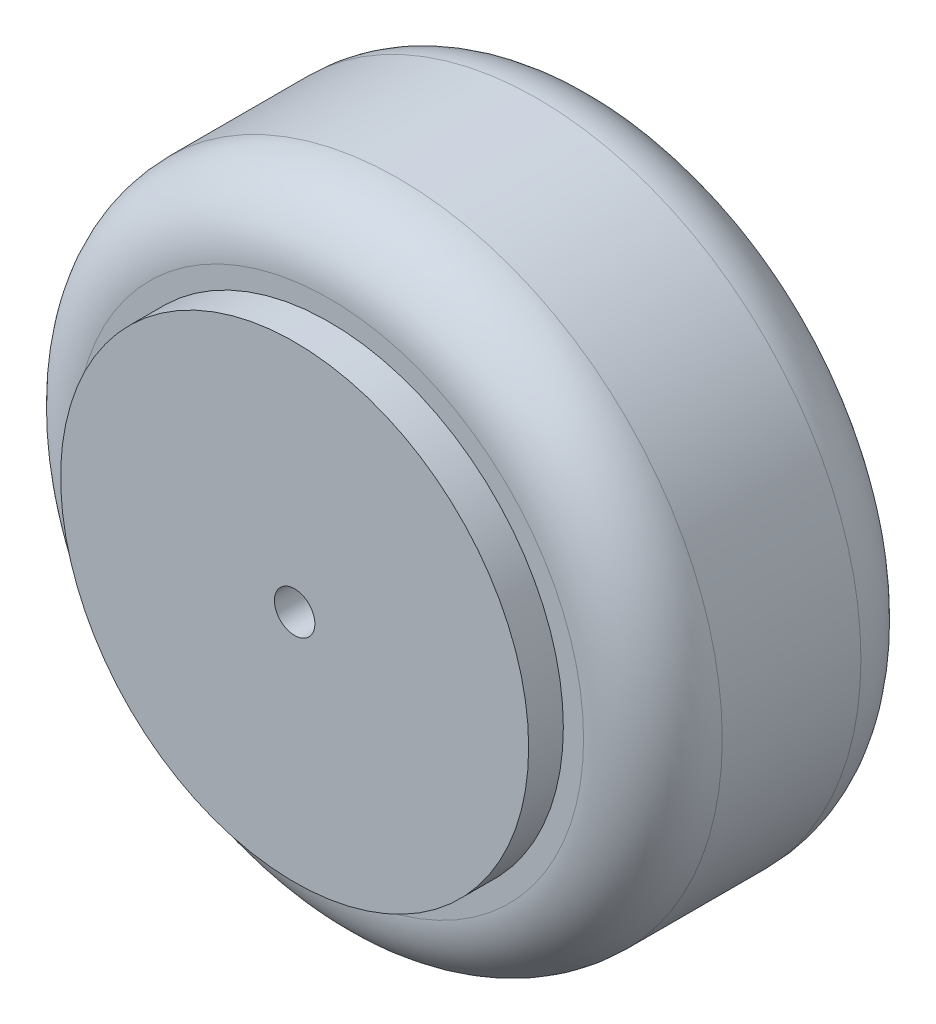
ISO-10303-21;
HEADER;
FILE_DESCRIPTION(('STEP AP214'),'2;1');
FILE_NAME('part.step','',(''),(''),'','','');
FILE_SCHEMA(('AUTOMOTIVE_DESIGN { 1 0 10303 214 1 1 1 1 }'));
ENDSEC;
DATA;
#1=APPLICATION_CONTEXT('core data for automotive mechanical design processes');
#2=APPLICATION_PROTOCOL_DEFINITION('international standard','automotive_design',2000,#1);
#3=PRODUCT_CONTEXT('',#1,'mechanical');
#4=PRODUCT('Part','Part','',(#3));
#5=PRODUCT_RELATED_PRODUCT_CATEGORY('part','',(#4));
#6=PRODUCT_DEFINITION_FORMATION('','',#4);
#7=PRODUCT_DEFINITION_CONTEXT('part definition',#1,'design');
#8=PRODUCT_DEFINITION('design','',#6,#7);
#9=PRODUCT_DEFINITION_SHAPE('','',#8);
#10=(LENGTH_UNIT() NAMED_UNIT(*) SI_UNIT(.MILLI.,.METRE.));
#11=(NAMED_UNIT(*) PLANE_ANGLE_UNIT() SI_UNIT($,.RADIAN.));
#12=(NAMED_UNIT(*) SI_UNIT($,.STERADIAN.) SOLID_ANGLE_UNIT());
#13=UNCERTAINTY_MEASURE_WITH_UNIT(LENGTH_MEASURE(1.E-05),#10,'distance_accuracy_value','');
#14=(GEOMETRIC_REPRESENTATION_CONTEXT(3) GLOBAL_UNCERTAINTY_ASSIGNED_CONTEXT((#13)) GLOBAL_UNIT_ASSIGNED_CONTEXT((#10,
#11,#12)) REPRESENTATION_CONTEXT('',''));
#15=CARTESIAN_POINT('',(0.,0.,0.));
#16=DIRECTION('',(0.,0.,1.));
#17=DIRECTION('',(1.,0.,0.));
#18=AXIS2_PLACEMENT_3D('',#15,#16,#17);
#19=CARTESIAN_POINT('',(0.,0.,6.));
#20=DIRECTION('',(0.,0.,-1.));
#21=DIRECTION('',(-1.,0.,0.));
#22=AXIS2_PLACEMENT_3D('',#19,#20,#21);
#23=CYLINDRICAL_SURFACE('',#22,40.5);
#24=CARTESIAN_POINT('',(0.,0.,6.));
#25=DIRECTION('',(0.,0.,1.));
#26=DIRECTION('',(1.,0.,0.));
#27=AXIS2_PLACEMENT_3D('',#24,#25,#26);
#28=CIRCLE('',#27,40.5);
#29=CARTESIAN_POINT('',(40.5,0.,6.));
#30=VERTEX_POINT('',#29);
#31=EDGE_CURVE('E103',#30,#30,#28,.T.);
#32=ORIENTED_EDGE('',*,*,#31,.F.);
#33=EDGE_LOOP('',(#32));
#34=FACE_BOUND('',#33,.T.);
#35=CARTESIAN_POINT('',(0.,0.,0.));
#36=DIRECTION('',(0.,0.,1.));
#37=DIRECTION('',(1.,0.,0.));
#38=AXIS2_PLACEMENT_3D('',#35,#36,#37);
#39=CIRCLE('',#38,40.5);
#40=CARTESIAN_POINT('',(40.5,0.,0.));
#41=VERTEX_POINT('',#40);
#42=EDGE_CURVE('E102',#41,#41,#39,.T.);
#43=ORIENTED_EDGE('',*,*,#42,.T.);
#44=EDGE_LOOP('',(#43));
#45=FACE_BOUND('',#44,.T.);
#46=ADVANCED_FACE('F44',(#34,#45),#23,.T.);
#47=CARTESIAN_POINT('',(0.,0.,6.));
#48=DIRECTION('',(0.,0.,1.));
#49=DIRECTION('',(1.,0.,0.));
#50=AXIS2_PLACEMENT_3D('',#47,#48,#49);
#51=PLANE('',#50);
#52=CARTESIAN_POINT('',(0.,0.,6.));
#53=DIRECTION('',(0.,0.,-1.));
#54=DIRECTION('',(-1.,0.,0.));
#55=AXIS2_PLACEMENT_3D('',#52,#53,#54);
#56=CIRCLE('',#55,3.5);
#57=CARTESIAN_POINT('',(-3.5,0.,6.));
#58=VERTEX_POINT('',#57);
#59=EDGE_CURVE('E128',#58,#58,#56,.T.);
#60=ORIENTED_EDGE('',*,*,#59,.T.);
#61=EDGE_LOOP('',(#60));
#62=FACE_BOUND('',#61,.T.);
#63=ORIENTED_EDGE('',*,*,#31,.T.);
#64=EDGE_LOOP('',(#63));
#65=FACE_BOUND('',#64,.T.);
#66=ADVANCED_FACE('F134',(#62,#65),#51,.T.);
#67=CARTESIAN_POINT('',(56.,0.,-48.));
#68=DIRECTION('',(0.,0.,-1.));
#69=DIRECTION('',(-1.,0.,0.));
#70=AXIS2_PLACEMENT_3D('',#67,#68,#69);
#71=PLANE('',#70);
#72=CARTESIAN_POINT('',(0.,0.,-48.));
#73=DIRECTION('',(0.,0.,-1.));
#74=DIRECTION('',(-1.,0.,0.));
#75=AXIS2_PLACEMENT_3D('',#72,#73,#74);
#76=CIRCLE('',#75,44.);
#77=CARTESIAN_POINT('',(44.,0.,-48.));
#78=VERTEX_POINT('',#77);
#79=EDGE_CURVE('E117',#78,#78,#76,.T.);
#80=ORIENTED_EDGE('',*,*,#79,.T.);
#81=EDGE_LOOP('',(#80));
#82=FACE_BOUND('',#81,.T.);
#83=CARTESIAN_POINT('',(0.,0.,-48.));
#84=DIRECTION('',(0.,0.,-1.));
#85=DIRECTION('',(-1.,0.,0.));
#86=AXIS2_PLACEMENT_3D('',#83,#84,#85);
#87=CIRCLE('',#86,28.);
#88=CARTESIAN_POINT('',(28.,0.,-48.));
#89=VERTEX_POINT('',#88);
#90=EDGE_CURVE('E53',#89,#89,#87,.F.);
#91=ORIENTED_EDGE('',*,*,#90,.T.);
#92=EDGE_LOOP('',(#91));
#93=FACE_BOUND('',#92,.T.);
#94=ADVANCED_FACE('F152',(#82,#93),#71,.T.);
#95=CARTESIAN_POINT('',(0.,0.,-24.));
#96=DIRECTION('',(0.,0.,1.));
#97=DIRECTION('',(1.,0.,0.));
#98=AXIS2_PLACEMENT_3D('',#95,#96,#97);
#99=CYLINDRICAL_SURFACE('',#98,56.);
#100=DIRECTION('',(0.,0.,-1.));
#101=VECTOR('',#100,1.);
#102=CARTESIAN_POINT('',(56.,0.,-48.));
#103=LINE('',#102,#101);
#104=CARTESIAN_POINT('',(56.,0.,-12.));
#105=VERTEX_POINT('',#104);
#106=CARTESIAN_POINT('',(56.,0.,-36.));
#107=VERTEX_POINT('',#106);
#108=EDGE_CURVE('E91',#105,#107,#103,.T.);
#109=ORIENTED_EDGE('',*,*,#108,.F.);
#110=CARTESIAN_POINT('',(0.,0.,-12.));
#111=DIRECTION('',(0.,0.,1.));
#112=DIRECTION('',(1.,0.,0.));
#113=AXIS2_PLACEMENT_3D('',#110,#111,#112);
#114=CIRCLE('',#113,56.);
#115=EDGE_CURVE('E114',#105,#105,#114,.F.);
#116=ORIENTED_EDGE('',*,*,#115,.T.);
#117=ORIENTED_EDGE('',*,*,#108,.T.);
#118=CARTESIAN_POINT('',(0.,0.,-36.));
#119=DIRECTION('',(0.,0.,-1.));
#120=DIRECTION('',(-1.,0.,0.));
#121=AXIS2_PLACEMENT_3D('',#118,#119,#120);
#122=CIRCLE('',#121,56.);
#123=EDGE_CURVE('E111',#107,#107,#122,.F.);
#124=ORIENTED_EDGE('',*,*,#123,.T.);
#125=EDGE_LOOP('',(#109,#116,#117,#124));
#126=FACE_BOUND('',#125,.T.);
#127=ADVANCED_FACE('F170',(#126),#99,.T.);
#128=CARTESIAN_POINT('',(56.,0.,0.));
#129=DIRECTION('',(0.,0.,1.));
#130=DIRECTION('',(1.,0.,0.));
#131=AXIS2_PLACEMENT_3D('',#128,#129,#130);
#132=PLANE('',#131);
#133=ORIENTED_EDGE('',*,*,#42,.F.);
#134=EDGE_LOOP('',(#133));
#135=FACE_BOUND('',#134,.T.);
#136=CARTESIAN_POINT('',(0.,0.,0.));
#137=DIRECTION('',(0.,0.,1.));
#138=DIRECTION('',(1.,0.,0.));
#139=AXIS2_PLACEMENT_3D('',#136,#137,#138);
#140=CIRCLE('',#139,44.);
#141=CARTESIAN_POINT('',(44.,0.,0.));
#142=VERTEX_POINT('',#141);
#143=EDGE_CURVE('E106',#142,#142,#140,.T.);
#144=ORIENTED_EDGE('',*,*,#143,.T.);
#145=EDGE_LOOP('',(#144));
#146=FACE_BOUND('',#145,.T.);
#147=ADVANCED_FACE('F174',(#135,#146),#132,.T.);
#148=CARTESIAN_POINT('',(0.,0.,-24.));
#149=DIRECTION('',(0.,0.,1.));
#150=DIRECTION('',(1.,0.,0.));
#151=AXIS2_PLACEMENT_3D('',#148,#149,#150);
#152=CYLINDRICAL_SURFACE('',#151,16.);
#153=CARTESIAN_POINT('',(0.,0.,-34.));
#154=DIRECTION('',(0.,0.,-1.));
#155=DIRECTION('',(-1.,0.,0.));
#156=AXIS2_PLACEMENT_3D('',#153,#154,#155);
#157=CIRCLE('',#156,16.);
#158=CARTESIAN_POINT('',(16.,0.,-34.));
#159=VERTEX_POINT('',#158);
#160=EDGE_CURVE('E86',#159,#159,#157,.T.);
#161=ORIENTED_EDGE('',*,*,#160,.F.);
#162=DIRECTION('',(0.,0.,1.));
#163=VECTOR('',#162,1.);
#164=CARTESIAN_POINT('',(16.,0.,-48.));
#165=LINE('',#164,#163);
#166=CARTESIAN_POINT('',(16.,0.,-36.));
#167=VERTEX_POINT('',#166);
#168=EDGE_CURVE('E83',#167,#159,#165,.T.);
#169=ORIENTED_EDGE('',*,*,#168,.F.);
#170=CARTESIAN_POINT('',(0.,0.,-36.));
#171=DIRECTION('',(0.,0.,-1.));
#172=DIRECTION('',(-1.,0.,0.));
#173=AXIS2_PLACEMENT_3D('',#170,#171,#172);
#174=CIRCLE('',#173,16.);
#175=EDGE_CURVE('E13',#167,#167,#174,.T.);
#176=ORIENTED_EDGE('',*,*,#175,.T.);
#177=ORIENTED_EDGE('',*,*,#168,.T.);
#178=EDGE_LOOP('',(#161,#169,#176,#177));
#179=FACE_BOUND('',#178,.T.);
#180=ADVANCED_FACE('F84',(#179),#152,.F.);
#181=CARTESIAN_POINT('',(0.,0.,-12.));
#182=DIRECTION('',(0.,0.,1.));
#183=DIRECTION('',(1.,0.,0.));
#184=AXIS2_PLACEMENT_3D('',#181,#182,#183);
#185=TOROIDAL_SURFACE('',#184,44.,12.);
#186=CARTESIAN_POINT('',(44.,0.,-12.));
#187=DIRECTION('',(0.,-1.,0.));
#188=DIRECTION('',(0.,0.,-1.));
#189=AXIS2_PLACEMENT_3D('',#186,#187,#188);
#190=CIRCLE('',#189,12.);
#191=EDGE_CURVE('E88',#105,#142,#190,.T.);
#192=ORIENTED_EDGE('',*,*,#191,.F.);
#193=ORIENTED_EDGE('',*,*,#115,.F.);
#194=ORIENTED_EDGE('',*,*,#191,.T.);
#195=ORIENTED_EDGE('',*,*,#143,.F.);
#196=EDGE_LOOP('',(#192,#193,#194,#195));
#197=FACE_BOUND('',#196,.T.);
#198=ADVANCED_FACE('F158',(#197),#185,.T.);
#199=CARTESIAN_POINT('',(0.,0.,-36.));
#200=DIRECTION('',(0.,0.,-1.));
#201=DIRECTION('',(-1.,0.,0.));
#202=AXIS2_PLACEMENT_3D('',#199,#200,#201);
#203=TOROIDAL_SURFACE('',#202,28.,12.);
#204=CARTESIAN_POINT('',(28.,0.,-36.));
#205=DIRECTION('',(0.,-1.,0.));
#206=DIRECTION('',(0.,0.,-1.));
#207=AXIS2_PLACEMENT_3D('',#204,#205,#206);
#208=CIRCLE('',#207,12.);
#209=EDGE_CURVE('E61',#167,#89,#208,.T.);
#210=ORIENTED_EDGE('',*,*,#209,.F.);
#211=ORIENTED_EDGE('',*,*,#175,.F.);
#212=ORIENTED_EDGE('',*,*,#209,.T.);
#213=ORIENTED_EDGE('',*,*,#90,.F.);
#214=EDGE_LOOP('',(#210,#211,#212,#213));
#215=FACE_BOUND('',#214,.T.);
#216=ADVANCED_FACE('F160',(#215),#203,.T.);
#217=CARTESIAN_POINT('',(0.,0.,-36.));
#218=DIRECTION('',(0.,0.,-1.));
#219=DIRECTION('',(-1.,0.,0.));
#220=AXIS2_PLACEMENT_3D('',#217,#218,#219);
#221=TOROIDAL_SURFACE('',#220,44.,12.);
#222=CARTESIAN_POINT('',(44.,0.,-36.));
#223=DIRECTION('',(0.,-1.,0.));
#224=DIRECTION('',(0.,0.,-1.));
#225=AXIS2_PLACEMENT_3D('',#222,#223,#224);
#226=CIRCLE('',#225,12.);
#227=EDGE_CURVE('E122',#78,#107,#226,.T.);
#228=ORIENTED_EDGE('',*,*,#227,.F.);
#229=ORIENTED_EDGE('',*,*,#79,.F.);
#230=ORIENTED_EDGE('',*,*,#227,.T.);
#231=ORIENTED_EDGE('',*,*,#123,.F.);
#232=EDGE_LOOP('',(#228,#229,#230,#231));
#233=FACE_BOUND('',#232,.T.);
#234=ADVANCED_FACE('F46',(#233),#221,.T.);
#235=CARTESIAN_POINT('',(0.,0.,-34.));
#236=DIRECTION('',(0.,0.,-1.));
#237=DIRECTION('',(-1.,0.,0.));
#238=AXIS2_PLACEMENT_3D('',#235,#236,#237);
#239=PLANE('',#238);
#240=CARTESIAN_POINT('',(0.,0.,-34.));
#241=DIRECTION('',(0.,0.,-1.));
#242=DIRECTION('',(-1.,0.,0.));
#243=AXIS2_PLACEMENT_3D('',#240,#241,#242);
#244=CIRCLE('',#243,3.5);
#245=CARTESIAN_POINT('',(-3.5,0.,-34.));
#246=VERTEX_POINT('',#245);
#247=EDGE_CURVE('E48',#246,#246,#244,.T.);
#248=ORIENTED_EDGE('',*,*,#247,.F.);
#249=EDGE_LOOP('',(#248));
#250=FACE_BOUND('',#249,.T.);
#251=ORIENTED_EDGE('',*,*,#160,.T.);
#252=EDGE_LOOP('',(#251));
#253=FACE_BOUND('',#252,.T.);
#254=ADVANCED_FACE('F139',(#250,#253),#239,.T.);
#255=CARTESIAN_POINT('',(0.,0.,6.));
#256=DIRECTION('',(0.,0.,-1.));
#257=DIRECTION('',(-1.,0.,0.));
#258=AXIS2_PLACEMENT_3D('',#255,#256,#257);
#259=CYLINDRICAL_SURFACE('',#258,3.5);
#260=ORIENTED_EDGE('',*,*,#247,.T.);
#261=EDGE_LOOP('',(#260));
#262=FACE_BOUND('',#261,.T.);
#263=ORIENTED_EDGE('',*,*,#59,.F.);
#264=EDGE_LOOP('',(#263));
#265=FACE_BOUND('',#264,.T.);
#266=ADVANCED_FACE('F137',(#262,#265),#259,.F.);
#267=CLOSED_SHELL('',(#46,#66,#94,#127,#147,#180,#198,#216,#234,#254,#266));
#268=MANIFOLD_SOLID_BREP('B2',#267);
#269=ADVANCED_BREP_SHAPE_REPRESENTATION('',(#18,#268),#14);
#270=SHAPE_DEFINITION_REPRESENTATION(#9,#269);
ENDSEC;
END-ISO-10303-21;
